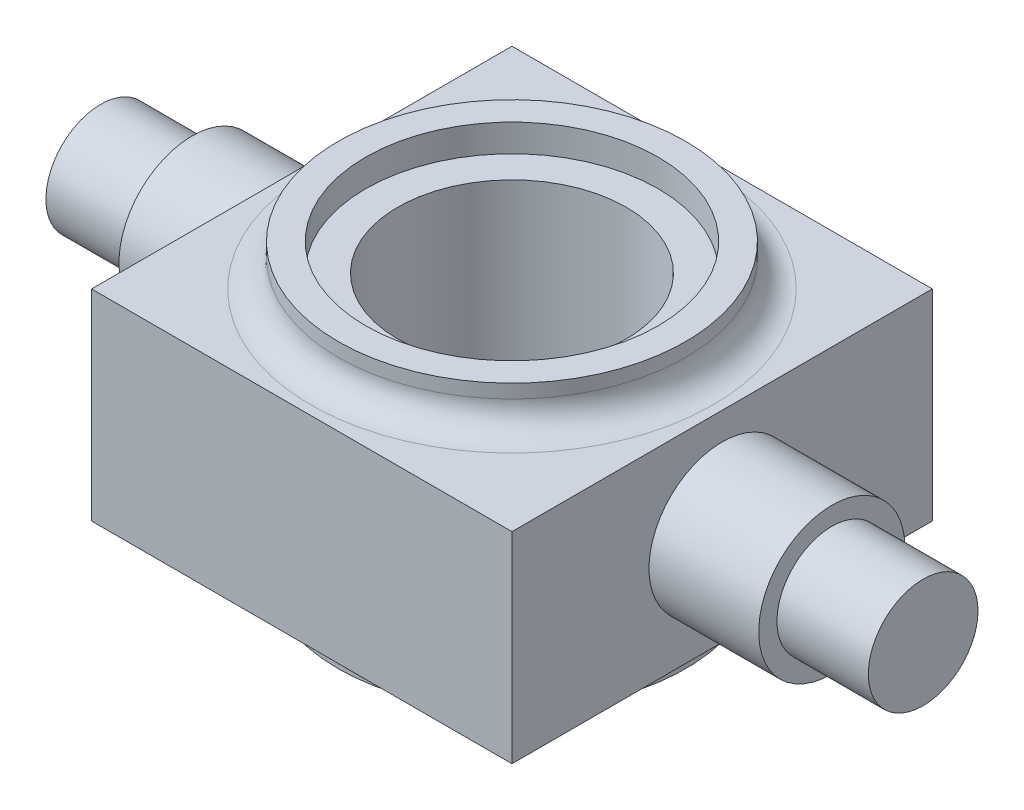
ISO-10303-21;
HEADER;
FILE_DESCRIPTION(('STEP AP214'),'2;1');
FILE_NAME('part.step','',(''),(''),'','','');
FILE_SCHEMA(('AUTOMOTIVE_DESIGN { 1 0 10303 214 1 1 1 1 }'));
ENDSEC;
DATA;
#1=APPLICATION_CONTEXT('core data for automotive mechanical design processes');
#2=APPLICATION_PROTOCOL_DEFINITION('international standard','automotive_design',2000,#1);
#3=PRODUCT_CONTEXT('',#1,'mechanical');
#4=PRODUCT('Part','Part','',(#3));
#5=PRODUCT_RELATED_PRODUCT_CATEGORY('part','',(#4));
#6=PRODUCT_DEFINITION_FORMATION('','',#4);
#7=PRODUCT_DEFINITION_CONTEXT('part definition',#1,'design');
#8=PRODUCT_DEFINITION('design','',#6,#7);
#9=PRODUCT_DEFINITION_SHAPE('','',#8);
#10=(LENGTH_UNIT() NAMED_UNIT(*) SI_UNIT(.MILLI.,.METRE.));
#11=(NAMED_UNIT(*) PLANE_ANGLE_UNIT() SI_UNIT($,.RADIAN.));
#12=(NAMED_UNIT(*) SI_UNIT($,.STERADIAN.) SOLID_ANGLE_UNIT());
#13=UNCERTAINTY_MEASURE_WITH_UNIT(LENGTH_MEASURE(1.E-05),#10,'distance_accuracy_value','');
#14=(GEOMETRIC_REPRESENTATION_CONTEXT(3) GLOBAL_UNCERTAINTY_ASSIGNED_CONTEXT((#13)) GLOBAL_UNIT_ASSIGNED_CONTEXT((#10,
#11,#12)) REPRESENTATION_CONTEXT('',''));
#15=CARTESIAN_POINT('',(0.,0.,0.));
#16=DIRECTION('',(0.,0.,1.));
#17=DIRECTION('',(1.,0.,0.));
#18=AXIS2_PLACEMENT_3D('',#15,#16,#17);
#19=CARTESIAN_POINT('',(-23.,11.,-23.));
#20=DIRECTION('',(1.,0.,0.));
#21=DIRECTION('',(0.,0.,-1.));
#22=AXIS2_PLACEMENT_3D('',#19,#20,#21);
#23=PLANE('',#22);
#24=CARTESIAN_POINT('',(-23.,0.,0.));
#25=DIRECTION('',(1.,0.,0.));
#26=DIRECTION('',(0.,0.,-1.));
#27=AXIS2_PLACEMENT_3D('',#24,#25,#26);
#28=CIRCLE('',#27,8.);
#29=CARTESIAN_POINT('',(-23.,0.,-8.));
#30=VERTEX_POINT('',#29);
#31=EDGE_CURVE('E256',#30,#30,#28,.T.);
#32=ORIENTED_EDGE('',*,*,#31,.T.);
#33=EDGE_LOOP('',(#32));
#34=FACE_BOUND('',#33,.T.);
#35=DIRECTION('',(0.,0.,1.));
#36=VECTOR('',#35,1.);
#37=CARTESIAN_POINT('',(-23.,-11.,-23.));
#38=LINE('',#37,#36);
#39=CARTESIAN_POINT('',(-23.,-11.,-23.));
#40=VERTEX_POINT('',#39);
#41=CARTESIAN_POINT('',(-23.,-11.,23.));
#42=VERTEX_POINT('',#41);
#43=EDGE_CURVE('E111',#40,#42,#38,.T.);
#44=ORIENTED_EDGE('',*,*,#43,.T.);
#45=DIRECTION('',(0.,-1.,0.));
#46=VECTOR('',#45,1.);
#47=CARTESIAN_POINT('',(-23.,11.,23.));
#48=LINE('',#47,#46);
#49=CARTESIAN_POINT('',(-23.,11.,23.));
#50=VERTEX_POINT('',#49);
#51=EDGE_CURVE('E102',#50,#42,#48,.T.);
#52=ORIENTED_EDGE('',*,*,#51,.F.);
#53=DIRECTION('',(0.,0.,1.));
#54=VECTOR('',#53,1.);
#55=CARTESIAN_POINT('',(-23.,11.,-23.));
#56=LINE('',#55,#54);
#57=CARTESIAN_POINT('',(-23.,11.,-23.));
#58=VERTEX_POINT('',#57);
#59=EDGE_CURVE('E96',#58,#50,#56,.T.);
#60=ORIENTED_EDGE('',*,*,#59,.F.);
#61=DIRECTION('',(0.,-1.,0.));
#62=VECTOR('',#61,1.);
#63=CARTESIAN_POINT('',(-23.,11.,-23.));
#64=LINE('',#63,#62);
#65=EDGE_CURVE('E107',#58,#40,#64,.T.);
#66=ORIENTED_EDGE('',*,*,#65,.T.);
#67=EDGE_LOOP('',(#44,#52,#60,#66));
#68=FACE_BOUND('',#67,.T.);
#69=ADVANCED_FACE('F43',(#34,#68),#23,.F.);
#70=CARTESIAN_POINT('',(23.,11.,23.));
#71=DIRECTION('',(0.,0.,-1.));
#72=DIRECTION('',(-1.,0.,0.));
#73=AXIS2_PLACEMENT_3D('',#70,#71,#72);
#74=PLANE('',#73);
#75=DIRECTION('',(1.,0.,0.));
#76=VECTOR('',#75,1.);
#77=CARTESIAN_POINT('',(23.,-11.,23.));
#78=LINE('',#77,#76);
#79=CARTESIAN_POINT('',(23.,-11.,23.));
#80=VERTEX_POINT('',#79);
#81=EDGE_CURVE('E101',#42,#80,#78,.T.);
#82=ORIENTED_EDGE('',*,*,#81,.T.);
#83=DIRECTION('',(0.,-1.,0.));
#84=VECTOR('',#83,1.);
#85=CARTESIAN_POINT('',(23.,11.,23.));
#86=LINE('',#85,#84);
#87=CARTESIAN_POINT('',(23.,11.,23.));
#88=VERTEX_POINT('',#87);
#89=EDGE_CURVE('E99',#88,#80,#86,.T.);
#90=ORIENTED_EDGE('',*,*,#89,.F.);
#91=DIRECTION('',(1.,0.,0.));
#92=VECTOR('',#91,1.);
#93=CARTESIAN_POINT('',(23.,11.,23.));
#94=LINE('',#93,#92);
#95=EDGE_CURVE('E91',#50,#88,#94,.T.);
#96=ORIENTED_EDGE('',*,*,#95,.F.);
#97=ORIENTED_EDGE('',*,*,#51,.T.);
#98=EDGE_LOOP('',(#82,#90,#96,#97));
#99=FACE_BOUND('',#98,.T.);
#100=ADVANCED_FACE('F100',(#99),#74,.F.);
#101=CARTESIAN_POINT('',(23.,11.,-23.));
#102=DIRECTION('',(-1.,0.,0.));
#103=DIRECTION('',(0.,0.,1.));
#104=AXIS2_PLACEMENT_3D('',#101,#102,#103);
#105=PLANE('',#104);
#106=CARTESIAN_POINT('',(23.,0.,0.));
#107=DIRECTION('',(1.,0.,0.));
#108=DIRECTION('',(0.,0.,-1.));
#109=AXIS2_PLACEMENT_3D('',#106,#107,#108);
#110=CIRCLE('',#109,8.);
#111=CARTESIAN_POINT('',(23.,0.,-8.));
#112=VERTEX_POINT('',#111);
#113=EDGE_CURVE('E121',#112,#112,#110,.T.);
#114=ORIENTED_EDGE('',*,*,#113,.F.);
#115=EDGE_LOOP('',(#114));
#116=FACE_BOUND('',#115,.T.);
#117=DIRECTION('',(0.,0.,-1.));
#118=VECTOR('',#117,1.);
#119=CARTESIAN_POINT('',(23.,-11.,-23.));
#120=LINE('',#119,#118);
#121=CARTESIAN_POINT('',(23.,-11.,-23.));
#122=VERTEX_POINT('',#121);
#123=EDGE_CURVE('E77',#80,#122,#120,.T.);
#124=ORIENTED_EDGE('',*,*,#123,.T.);
#125=DIRECTION('',(0.,-1.,0.));
#126=VECTOR('',#125,1.);
#127=CARTESIAN_POINT('',(23.,11.,-23.));
#128=LINE('',#127,#126);
#129=CARTESIAN_POINT('',(23.,11.,-23.));
#130=VERTEX_POINT('',#129);
#131=EDGE_CURVE('E103',#130,#122,#128,.T.);
#132=ORIENTED_EDGE('',*,*,#131,.F.);
#133=DIRECTION('',(0.,0.,-1.));
#134=VECTOR('',#133,1.);
#135=CARTESIAN_POINT('',(23.,11.,-23.));
#136=LINE('',#135,#134);
#137=EDGE_CURVE('E94',#88,#130,#136,.T.);
#138=ORIENTED_EDGE('',*,*,#137,.F.);
#139=ORIENTED_EDGE('',*,*,#89,.T.);
#140=EDGE_LOOP('',(#124,#132,#138,#139));
#141=FACE_BOUND('',#140,.T.);
#142=ADVANCED_FACE('F105',(#116,#141),#105,.F.);
#143=CARTESIAN_POINT('',(23.,11.,-23.));
#144=DIRECTION('',(0.,0.,1.));
#145=DIRECTION('',(1.,0.,0.));
#146=AXIS2_PLACEMENT_3D('',#143,#144,#145);
#147=PLANE('',#146);
#148=DIRECTION('',(-1.,0.,0.));
#149=VECTOR('',#148,1.);
#150=CARTESIAN_POINT('',(23.,-11.,-23.));
#151=LINE('',#150,#149);
#152=EDGE_CURVE('E83',#122,#40,#151,.T.);
#153=ORIENTED_EDGE('',*,*,#152,.T.);
#154=ORIENTED_EDGE('',*,*,#65,.F.);
#155=DIRECTION('',(-1.,0.,0.));
#156=VECTOR('',#155,1.);
#157=CARTESIAN_POINT('',(23.,11.,-23.));
#158=LINE('',#157,#156);
#159=EDGE_CURVE('E60',#130,#58,#158,.T.);
#160=ORIENTED_EDGE('',*,*,#159,.F.);
#161=ORIENTED_EDGE('',*,*,#131,.T.);
#162=EDGE_LOOP('',(#153,#154,#160,#161));
#163=FACE_BOUND('',#162,.T.);
#164=ADVANCED_FACE('F175',(#163),#147,.F.);
#165=CARTESIAN_POINT('',(0.,11.,0.));
#166=DIRECTION('',(0.,-1.,0.));
#167=DIRECTION('',(0.,0.,-1.));
#168=AXIS2_PLACEMENT_3D('',#165,#166,#167);
#169=PLANE('',#168);
#170=CARTESIAN_POINT('',(0.,11.,0.));
#171=DIRECTION('',(0.,-1.,0.));
#172=DIRECTION('',(0.,0.,-1.));
#173=AXIS2_PLACEMENT_3D('',#170,#171,#172);
#174=CIRCLE('',#173,22.);
#175=CARTESIAN_POINT('',(0.,11.,-22.));
#176=VERTEX_POINT('',#175);
#177=EDGE_CURVE('E11',#176,#176,#174,.T.);
#178=ORIENTED_EDGE('',*,*,#177,.T.);
#179=EDGE_LOOP('',(#178));
#180=FACE_BOUND('',#179,.T.);
#181=ORIENTED_EDGE('',*,*,#59,.T.);
#182=ORIENTED_EDGE('',*,*,#95,.T.);
#183=ORIENTED_EDGE('',*,*,#137,.T.);
#184=ORIENTED_EDGE('',*,*,#159,.T.);
#185=EDGE_LOOP('',(#181,#182,#183,#184));
#186=FACE_BOUND('',#185,.T.);
#187=ADVANCED_FACE('F92',(#180,#186),#169,.F.);
#188=CARTESIAN_POINT('',(0.,-11.,0.));
#189=DIRECTION('',(0.,-1.,0.));
#190=DIRECTION('',(0.,0.,-1.));
#191=AXIS2_PLACEMENT_3D('',#188,#189,#190);
#192=PLANE('',#191);
#193=CARTESIAN_POINT('',(0.,-11.,0.));
#194=DIRECTION('',(0.,-1.,0.));
#195=DIRECTION('',(0.,0.,-1.));
#196=AXIS2_PLACEMENT_3D('',#193,#194,#195);
#197=CIRCLE('',#196,22.);
#198=CARTESIAN_POINT('',(0.,-11.,-22.));
#199=VERTEX_POINT('',#198);
#200=EDGE_CURVE('E143',#199,#199,#197,.F.);
#201=ORIENTED_EDGE('',*,*,#200,.T.);
#202=EDGE_LOOP('',(#201));
#203=FACE_BOUND('',#202,.T.);
#204=ORIENTED_EDGE('',*,*,#43,.F.);
#205=ORIENTED_EDGE('',*,*,#152,.F.);
#206=ORIENTED_EDGE('',*,*,#123,.F.);
#207=ORIENTED_EDGE('',*,*,#81,.F.);
#208=EDGE_LOOP('',(#204,#205,#206,#207));
#209=FACE_BOUND('',#208,.T.);
#210=ADVANCED_FACE('F179',(#203,#209),#192,.T.);
#211=CARTESIAN_POINT('',(0.,15.5,0.));
#212=DIRECTION('',(0.,-1.,0.));
#213=DIRECTION('',(0.,0.,-1.));
#214=AXIS2_PLACEMENT_3D('',#211,#212,#213);
#215=CYLINDRICAL_SURFACE('',#214,19.);
#216=CARTESIAN_POINT('',(0.,14.,0.));
#217=DIRECTION('',(0.,-1.,0.));
#218=DIRECTION('',(0.,0.,-1.));
#219=AXIS2_PLACEMENT_3D('',#216,#217,#218);
#220=CIRCLE('',#219,19.);
#221=CARTESIAN_POINT('',(0.,14.,-19.));
#222=VERTEX_POINT('',#221);
#223=EDGE_CURVE('E52',#222,#222,#220,.F.);
#224=ORIENTED_EDGE('',*,*,#223,.T.);
#225=EDGE_LOOP('',(#224));
#226=FACE_BOUND('',#225,.T.);
#227=CARTESIAN_POINT('',(0.,15.5,0.));
#228=DIRECTION('',(0.,1.,0.));
#229=DIRECTION('',(0.,0.,1.));
#230=AXIS2_PLACEMENT_3D('',#227,#228,#229);
#231=CIRCLE('',#230,19.);
#232=CARTESIAN_POINT('',(0.,15.5,19.));
#233=VERTEX_POINT('',#232);
#234=EDGE_CURVE('E114',#233,#233,#231,.T.);
#235=ORIENTED_EDGE('',*,*,#234,.F.);
#236=EDGE_LOOP('',(#235));
#237=FACE_BOUND('',#236,.T.);
#238=ADVANCED_FACE('F151',(#226,#237),#215,.T.);
#239=CARTESIAN_POINT('',(0.,15.5,0.));
#240=DIRECTION('',(0.,1.,0.));
#241=DIRECTION('',(0.,0.,1.));
#242=AXIS2_PLACEMENT_3D('',#239,#240,#241);
#243=PLANE('',#242);
#244=CARTESIAN_POINT('',(0.,15.5,0.));
#245=DIRECTION('',(0.,1.,0.));
#246=DIRECTION('',(0.,0.,1.));
#247=AXIS2_PLACEMENT_3D('',#244,#245,#246);
#248=CIRCLE('',#247,16.);
#249=CARTESIAN_POINT('',(0.,15.5,16.));
#250=VERTEX_POINT('',#249);
#251=EDGE_CURVE('E122',#250,#250,#248,.F.);
#252=ORIENTED_EDGE('',*,*,#251,.T.);
#253=EDGE_LOOP('',(#252));
#254=FACE_BOUND('',#253,.T.);
#255=ORIENTED_EDGE('',*,*,#234,.T.);
#256=EDGE_LOOP('',(#255));
#257=FACE_BOUND('',#256,.T.);
#258=ADVANCED_FACE('F188',(#254,#257),#243,.T.);
#259=CARTESIAN_POINT('',(0.,-15.5,0.));
#260=DIRECTION('',(0.,1.,0.));
#261=DIRECTION('',(0.,0.,1.));
#262=AXIS2_PLACEMENT_3D('',#259,#260,#261);
#263=CYLINDRICAL_SURFACE('',#262,19.);
#264=CARTESIAN_POINT('',(0.,-14.,0.));
#265=DIRECTION('',(0.,-1.,0.));
#266=DIRECTION('',(0.,0.,-1.));
#267=AXIS2_PLACEMENT_3D('',#264,#265,#266);
#268=CIRCLE('',#267,19.);
#269=CARTESIAN_POINT('',(0.,-14.,-19.));
#270=VERTEX_POINT('',#269);
#271=EDGE_CURVE('E146',#270,#270,#268,.T.);
#272=ORIENTED_EDGE('',*,*,#271,.T.);
#273=EDGE_LOOP('',(#272));
#274=FACE_BOUND('',#273,.T.);
#275=CARTESIAN_POINT('',(0.,-15.5,0.));
#276=DIRECTION('',(0.,1.,0.));
#277=DIRECTION('',(0.,0.,1.));
#278=AXIS2_PLACEMENT_3D('',#275,#276,#277);
#279=CIRCLE('',#278,19.);
#280=CARTESIAN_POINT('',(0.,-15.5,19.));
#281=VERTEX_POINT('',#280);
#282=EDGE_CURVE('E125',#281,#281,#279,.T.);
#283=ORIENTED_EDGE('',*,*,#282,.T.);
#284=EDGE_LOOP('',(#283));
#285=FACE_BOUND('',#284,.T.);
#286=ADVANCED_FACE('F191',(#274,#285),#263,.T.);
#287=CARTESIAN_POINT('',(0.,-15.5,0.));
#288=DIRECTION('',(0.,-1.,0.));
#289=DIRECTION('',(0.,0.,1.));
#290=AXIS2_PLACEMENT_3D('',#287,#288,#289);
#291=PLANE('',#290);
#292=CARTESIAN_POINT('',(0.,-15.5,0.));
#293=DIRECTION('',(0.,-1.,0.));
#294=DIRECTION('',(0.,0.,-1.));
#295=AXIS2_PLACEMENT_3D('',#292,#293,#294);
#296=CIRCLE('',#295,16.);
#297=CARTESIAN_POINT('',(0.,-15.5,-16.));
#298=VERTEX_POINT('',#297);
#299=EDGE_CURVE('E127',#298,#298,#296,.T.);
#300=ORIENTED_EDGE('',*,*,#299,.F.);
#301=EDGE_LOOP('',(#300));
#302=FACE_BOUND('',#301,.T.);
#303=ORIENTED_EDGE('',*,*,#282,.F.);
#304=EDGE_LOOP('',(#303));
#305=FACE_BOUND('',#304,.T.);
#306=ADVANCED_FACE('F195',(#302,#305),#291,.T.);
#307=CARTESIAN_POINT('',(0.,15.500012,0.));
#308=DIRECTION('',(0.,-1.,0.));
#309=DIRECTION('',(0.,0.,-1.));
#310=AXIS2_PLACEMENT_3D('',#307,#308,#309);
#311=CYLINDRICAL_SURFACE('',#310,16.);
#312=ORIENTED_EDGE('',*,*,#251,.F.);
#313=EDGE_LOOP('',(#312));
#314=FACE_BOUND('',#313,.T.);
#315=CARTESIAN_POINT('',(0.,12.5,0.));
#316=DIRECTION('',(0.,1.,0.));
#317=DIRECTION('',(0.,0.,1.));
#318=AXIS2_PLACEMENT_3D('',#315,#316,#317);
#319=CIRCLE('',#318,16.);
#320=CARTESIAN_POINT('',(0.,12.5,16.));
#321=VERTEX_POINT('',#320);
#322=EDGE_CURVE('E126',#321,#321,#319,.T.);
#323=ORIENTED_EDGE('',*,*,#322,.F.);
#324=EDGE_LOOP('',(#323));
#325=FACE_BOUND('',#324,.T.);
#326=ADVANCED_FACE('F199',(#314,#325),#311,.F.);
#327=CARTESIAN_POINT('',(0.,12.5,0.));
#328=DIRECTION('',(0.,1.,0.));
#329=DIRECTION('',(0.,0.,1.));
#330=AXIS2_PLACEMENT_3D('',#327,#328,#329);
#331=PLANE('',#330);
#332=CARTESIAN_POINT('',(0.,12.5,0.));
#333=DIRECTION('',(0.,1.,0.));
#334=DIRECTION('',(0.,0.,1.));
#335=AXIS2_PLACEMENT_3D('',#332,#333,#334);
#336=CIRCLE('',#335,12.5);
#337=CARTESIAN_POINT('',(0.,12.5,12.5));
#338=VERTEX_POINT('',#337);
#339=EDGE_CURVE('E134',#338,#338,#336,.T.);
#340=ORIENTED_EDGE('',*,*,#339,.F.);
#341=EDGE_LOOP('',(#340));
#342=FACE_BOUND('',#341,.T.);
#343=ORIENTED_EDGE('',*,*,#322,.T.);
#344=EDGE_LOOP('',(#343));
#345=FACE_BOUND('',#344,.T.);
#346=ADVANCED_FACE('F203',(#342,#345),#331,.T.);
#347=CARTESIAN_POINT('',(0.,-15.500012,0.));
#348=DIRECTION('',(0.,1.,0.));
#349=DIRECTION('',(0.,0.,1.));
#350=AXIS2_PLACEMENT_3D('',#347,#348,#349);
#351=CYLINDRICAL_SURFACE('',#350,16.);
#352=ORIENTED_EDGE('',*,*,#299,.T.);
#353=EDGE_LOOP('',(#352));
#354=FACE_BOUND('',#353,.T.);
#355=CARTESIAN_POINT('',(0.,-12.5,0.));
#356=DIRECTION('',(0.,1.,0.));
#357=DIRECTION('',(0.,0.,1.));
#358=AXIS2_PLACEMENT_3D('',#355,#356,#357);
#359=CIRCLE('',#358,16.);
#360=CARTESIAN_POINT('',(0.,-12.5,16.));
#361=VERTEX_POINT('',#360);
#362=EDGE_CURVE('E130',#361,#361,#359,.T.);
#363=ORIENTED_EDGE('',*,*,#362,.T.);
#364=EDGE_LOOP('',(#363));
#365=FACE_BOUND('',#364,.T.);
#366=ADVANCED_FACE('F207',(#354,#365),#351,.F.);
#367=CARTESIAN_POINT('',(0.,-12.5,0.));
#368=DIRECTION('',(0.,-1.,0.));
#369=DIRECTION('',(0.,0.,1.));
#370=AXIS2_PLACEMENT_3D('',#367,#368,#369);
#371=PLANE('',#370);
#372=CARTESIAN_POINT('',(0.,-12.5,0.));
#373=DIRECTION('',(0.,-1.,0.));
#374=DIRECTION('',(0.,0.,-1.));
#375=AXIS2_PLACEMENT_3D('',#372,#373,#374);
#376=CIRCLE('',#375,12.5);
#377=CARTESIAN_POINT('',(0.,-12.5,-12.5));
#378=VERTEX_POINT('',#377);
#379=EDGE_CURVE('E131',#378,#378,#376,.T.);
#380=ORIENTED_EDGE('',*,*,#379,.F.);
#381=EDGE_LOOP('',(#380));
#382=FACE_BOUND('',#381,.T.);
#383=ORIENTED_EDGE('',*,*,#362,.F.);
#384=EDGE_LOOP('',(#383));
#385=FACE_BOUND('',#384,.T.);
#386=ADVANCED_FACE('F211',(#382,#385),#371,.T.);
#387=CARTESIAN_POINT('',(0.,-15.5,0.));
#388=DIRECTION('',(0.,1.,0.));
#389=DIRECTION('',(0.,0.,1.));
#390=AXIS2_PLACEMENT_3D('',#387,#388,#389);
#391=CYLINDRICAL_SURFACE('',#390,12.5);
#392=ORIENTED_EDGE('',*,*,#379,.T.);
#393=EDGE_LOOP('',(#392));
#394=FACE_BOUND('',#393,.T.);
#395=ORIENTED_EDGE('',*,*,#339,.T.);
#396=EDGE_LOOP('',(#395));
#397=FACE_BOUND('',#396,.T.);
#398=ADVANCED_FACE('F215',(#394,#397),#391,.F.);
#399=CARTESIAN_POINT('',(35.,0.,0.));
#400=DIRECTION('',(-1.,0.,0.));
#401=DIRECTION('',(0.,0.,1.));
#402=AXIS2_PLACEMENT_3D('',#399,#400,#401);
#403=CYLINDRICAL_SURFACE('',#402,8.);
#404=CARTESIAN_POINT('',(35.,0.,0.));
#405=DIRECTION('',(1.,0.,0.));
#406=DIRECTION('',(0.,0.,-1.));
#407=AXIS2_PLACEMENT_3D('',#404,#405,#406);
#408=CIRCLE('',#407,8.);
#409=CARTESIAN_POINT('',(35.,0.,-8.));
#410=VERTEX_POINT('',#409);
#411=EDGE_CURVE('E138',#410,#410,#408,.T.);
#412=ORIENTED_EDGE('',*,*,#411,.F.);
#413=EDGE_LOOP('',(#412));
#414=FACE_BOUND('',#413,.T.);
#415=ORIENTED_EDGE('',*,*,#113,.T.);
#416=EDGE_LOOP('',(#415));
#417=FACE_BOUND('',#416,.T.);
#418=ADVANCED_FACE('F219',(#414,#417),#403,.T.);
#419=CARTESIAN_POINT('',(35.,0.,0.));
#420=DIRECTION('',(1.,0.,0.));
#421=DIRECTION('',(0.,0.,-1.));
#422=AXIS2_PLACEMENT_3D('',#419,#420,#421);
#423=PLANE('',#422);
#424=CARTESIAN_POINT('',(35.,0.,0.));
#425=DIRECTION('',(1.,0.,0.));
#426=DIRECTION('',(0.,0.,-1.));
#427=AXIS2_PLACEMENT_3D('',#424,#425,#426);
#428=CIRCLE('',#427,6.);
#429=CARTESIAN_POINT('',(35.,0.,-6.));
#430=VERTEX_POINT('',#429);
#431=EDGE_CURVE('E135',#430,#430,#428,.F.);
#432=ORIENTED_EDGE('',*,*,#431,.T.);
#433=EDGE_LOOP('',(#432));
#434=FACE_BOUND('',#433,.T.);
#435=ORIENTED_EDGE('',*,*,#411,.T.);
#436=EDGE_LOOP('',(#435));
#437=FACE_BOUND('',#436,.T.);
#438=ADVANCED_FACE('F223',(#434,#437),#423,.T.);
#439=CARTESIAN_POINT('',(45.,0.,0.));
#440=DIRECTION('',(-1.,0.,0.));
#441=DIRECTION('',(0.,0.,1.));
#442=AXIS2_PLACEMENT_3D('',#439,#440,#441);
#443=CYLINDRICAL_SURFACE('',#442,6.);
#444=ORIENTED_EDGE('',*,*,#431,.F.);
#445=EDGE_LOOP('',(#444));
#446=FACE_BOUND('',#445,.T.);
#447=CARTESIAN_POINT('',(45.,0.,0.));
#448=DIRECTION('',(1.,0.,0.));
#449=DIRECTION('',(0.,0.,-1.));
#450=AXIS2_PLACEMENT_3D('',#447,#448,#449);
#451=CIRCLE('',#450,6.);
#452=CARTESIAN_POINT('',(45.,0.,-6.));
#453=VERTEX_POINT('',#452);
#454=EDGE_CURVE('E139',#453,#453,#451,.T.);
#455=ORIENTED_EDGE('',*,*,#454,.F.);
#456=EDGE_LOOP('',(#455));
#457=FACE_BOUND('',#456,.T.);
#458=ADVANCED_FACE('F227',(#446,#457),#443,.T.);
#459=CARTESIAN_POINT('',(45.,0.,0.));
#460=DIRECTION('',(1.,0.,0.));
#461=DIRECTION('',(0.,0.,-1.));
#462=AXIS2_PLACEMENT_3D('',#459,#460,#461);
#463=PLANE('',#462);
#464=ORIENTED_EDGE('',*,*,#454,.T.);
#465=EDGE_LOOP('',(#464));
#466=FACE_BOUND('',#465,.T.);
#467=ADVANCED_FACE('F231',(#466),#463,.T.);
#468=CARTESIAN_POINT('',(-35.,0.,0.));
#469=DIRECTION('',(1.,0.,0.));
#470=DIRECTION('',(0.,0.,-1.));
#471=AXIS2_PLACEMENT_3D('',#468,#469,#470);
#472=CYLINDRICAL_SURFACE('',#471,8.);
#473=CARTESIAN_POINT('',(-35.,0.,0.));
#474=DIRECTION('',(1.,0.,0.));
#475=DIRECTION('',(0.,0.,-1.));
#476=AXIS2_PLACEMENT_3D('',#473,#474,#475);
#477=CIRCLE('',#476,8.);
#478=CARTESIAN_POINT('',(-35.,0.,-8.));
#479=VERTEX_POINT('',#478);
#480=EDGE_CURVE('E258',#479,#479,#477,.T.);
#481=ORIENTED_EDGE('',*,*,#480,.T.);
#482=EDGE_LOOP('',(#481));
#483=FACE_BOUND('',#482,.T.);
#484=ORIENTED_EDGE('',*,*,#31,.F.);
#485=EDGE_LOOP('',(#484));
#486=FACE_BOUND('',#485,.T.);
#487=ADVANCED_FACE('F235',(#483,#486),#472,.T.);
#488=CARTESIAN_POINT('',(-35.,0.,0.));
#489=DIRECTION('',(-1.,0.,0.));
#490=DIRECTION('',(0.,0.,-1.));
#491=AXIS2_PLACEMENT_3D('',#488,#489,#490);
#492=PLANE('',#491);
#493=CARTESIAN_POINT('',(-35.,0.,0.));
#494=DIRECTION('',(-1.,0.,0.));
#495=DIRECTION('',(0.,0.,1.));
#496=AXIS2_PLACEMENT_3D('',#493,#494,#495);
#497=CIRCLE('',#496,6.);
#498=CARTESIAN_POINT('',(-35.,0.,6.));
#499=VERTEX_POINT('',#498);
#500=EDGE_CURVE('E140',#499,#499,#497,.T.);
#501=ORIENTED_EDGE('',*,*,#500,.F.);
#502=EDGE_LOOP('',(#501));
#503=FACE_BOUND('',#502,.T.);
#504=ORIENTED_EDGE('',*,*,#480,.F.);
#505=EDGE_LOOP('',(#504));
#506=FACE_BOUND('',#505,.T.);
#507=ADVANCED_FACE('F239',(#503,#506),#492,.T.);
#508=CARTESIAN_POINT('',(-45.,0.,0.));
#509=DIRECTION('',(1.,0.,0.));
#510=DIRECTION('',(0.,0.,-1.));
#511=AXIS2_PLACEMENT_3D('',#508,#509,#510);
#512=CYLINDRICAL_SURFACE('',#511,6.);
#513=ORIENTED_EDGE('',*,*,#500,.T.);
#514=EDGE_LOOP('',(#513));
#515=FACE_BOUND('',#514,.T.);
#516=CARTESIAN_POINT('',(-45.,0.,0.));
#517=DIRECTION('',(1.,0.,0.));
#518=DIRECTION('',(0.,0.,-1.));
#519=AXIS2_PLACEMENT_3D('',#516,#517,#518);
#520=CIRCLE('',#519,6.);
#521=CARTESIAN_POINT('',(-45.,0.,-6.));
#522=VERTEX_POINT('',#521);
#523=EDGE_CURVE('E254',#522,#522,#520,.T.);
#524=ORIENTED_EDGE('',*,*,#523,.T.);
#525=EDGE_LOOP('',(#524));
#526=FACE_BOUND('',#525,.T.);
#527=ADVANCED_FACE('F243',(#515,#526),#512,.T.);
#528=CARTESIAN_POINT('',(-45.,0.,0.));
#529=DIRECTION('',(-1.,0.,0.));
#530=DIRECTION('',(0.,0.,-1.));
#531=AXIS2_PLACEMENT_3D('',#528,#529,#530);
#532=PLANE('',#531);
#533=ORIENTED_EDGE('',*,*,#523,.F.);
#534=EDGE_LOOP('',(#533));
#535=FACE_BOUND('',#534,.T.);
#536=ADVANCED_FACE('F160',(#535),#532,.T.);
#537=CARTESIAN_POINT('',(0.,-14.,0.));
#538=DIRECTION('',(0.,-1.,0.));
#539=DIRECTION('',(0.,0.,-1.));
#540=AXIS2_PLACEMENT_3D('',#537,#538,#539);
#541=TOROIDAL_SURFACE('',#540,22.,3.);
#542=ORIENTED_EDGE('',*,*,#271,.F.);
#543=EDGE_LOOP('',(#542));
#544=FACE_BOUND('',#543,.T.);
#545=ORIENTED_EDGE('',*,*,#200,.F.);
#546=EDGE_LOOP('',(#545));
#547=FACE_BOUND('',#546,.T.);
#548=ADVANCED_FACE('F155',(#544,#547),#541,.F.);
#549=CARTESIAN_POINT('',(0.,14.,0.));
#550=DIRECTION('',(0.,-1.,0.));
#551=DIRECTION('',(0.,0.,-1.));
#552=AXIS2_PLACEMENT_3D('',#549,#550,#551);
#553=TOROIDAL_SURFACE('',#552,22.,3.);
#554=ORIENTED_EDGE('',*,*,#177,.F.);
#555=EDGE_LOOP('',(#554));
#556=FACE_BOUND('',#555,.T.);
#557=ORIENTED_EDGE('',*,*,#223,.F.);
#558=EDGE_LOOP('',(#557));
#559=FACE_BOUND('',#558,.T.);
#560=ADVANCED_FACE('F45',(#556,#559),#553,.F.);
#561=CLOSED_SHELL('',(#69,#100,#142,#164,#187,#210,#238,#258,#286,#306,#326,#346,#366,#386,#398,
#418,#438,#458,#467,#487,#507,#527,#536,#548,#560));
#562=MANIFOLD_SOLID_BREP('B2',#561);
#563=ADVANCED_BREP_SHAPE_REPRESENTATION('',(#18,#562),#14);
#564=SHAPE_DEFINITION_REPRESENTATION(#9,#563);
ENDSEC;
END-ISO-10303-21;
